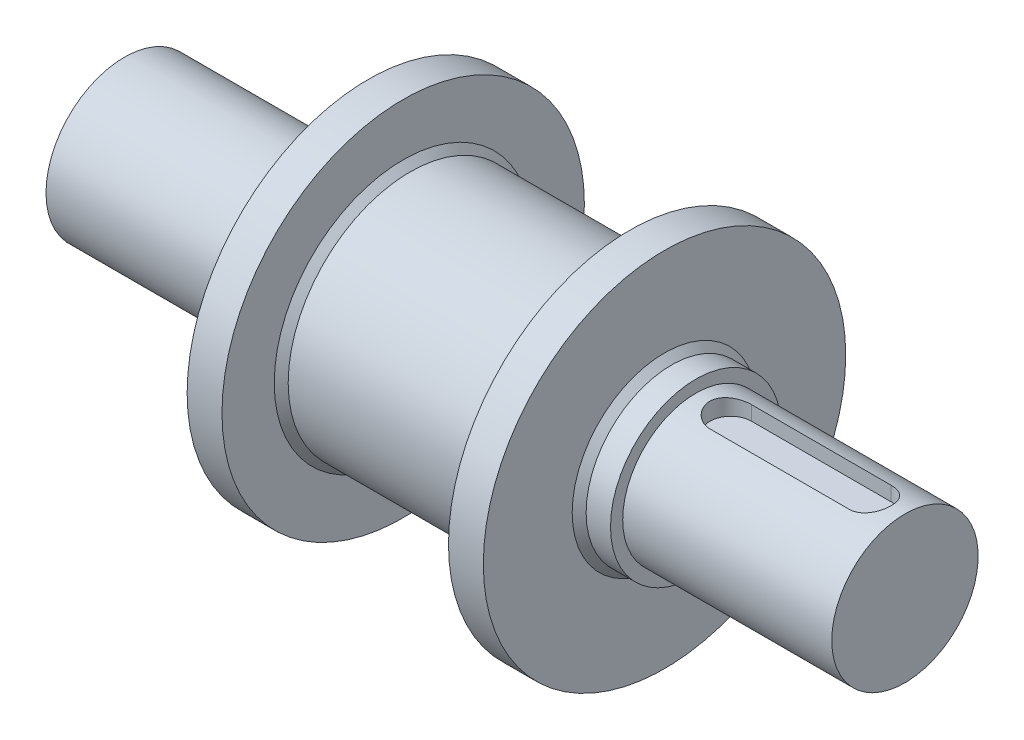
ISO-10303-21;
HEADER;
FILE_DESCRIPTION(('STEP AP214'),'2;1');
FILE_NAME('part.step','',(''),(''),'','','');
FILE_SCHEMA(('AUTOMOTIVE_DESIGN { 1 0 10303 214 1 1 1 1 }'));
ENDSEC;
DATA;
#1=APPLICATION_CONTEXT('core data for automotive mechanical design processes');
#2=APPLICATION_PROTOCOL_DEFINITION('international standard','automotive_design',2000,#1);
#3=PRODUCT_CONTEXT('',#1,'mechanical');
#4=PRODUCT('Part','Part','',(#3));
#5=PRODUCT_RELATED_PRODUCT_CATEGORY('part','',(#4));
#6=PRODUCT_DEFINITION_FORMATION('','',#4);
#7=PRODUCT_DEFINITION_CONTEXT('part definition',#1,'design');
#8=PRODUCT_DEFINITION('design','',#6,#7);
#9=PRODUCT_DEFINITION_SHAPE('','',#8);
#10=(LENGTH_UNIT() NAMED_UNIT(*) SI_UNIT(.MILLI.,.METRE.));
#11=(NAMED_UNIT(*) PLANE_ANGLE_UNIT() SI_UNIT($,.RADIAN.));
#12=(NAMED_UNIT(*) SI_UNIT($,.STERADIAN.) SOLID_ANGLE_UNIT());
#13=UNCERTAINTY_MEASURE_WITH_UNIT(LENGTH_MEASURE(1.E-05),#10,'distance_accuracy_value','');
#14=(GEOMETRIC_REPRESENTATION_CONTEXT(3) GLOBAL_UNCERTAINTY_ASSIGNED_CONTEXT((#13)) GLOBAL_UNIT_ASSIGNED_CONTEXT((#10,
#11,#12)) REPRESENTATION_CONTEXT('',''));
#15=CARTESIAN_POINT('',(0.,0.,0.));
#16=DIRECTION('',(0.,0.,1.));
#17=DIRECTION('',(1.,0.,0.));
#18=AXIS2_PLACEMENT_3D('',#15,#16,#17);
#19=CARTESIAN_POINT('',(0.,0.,0.));
#20=DIRECTION('',(-1.,0.,0.));
#21=DIRECTION('',(0.,0.,1.));
#22=AXIS2_PLACEMENT_3D('',#19,#20,#21);
#23=CYLINDRICAL_SURFACE('',#22,21.);
#24=CARTESIAN_POINT('',(164.,0.,0.));
#25=DIRECTION('',(-1.,0.,0.));
#26=DIRECTION('',(0.,0.,1.));
#27=AXIS2_PLACEMENT_3D('',#24,#25,#26);
#28=CIRCLE('',#27,21.);
#29=CARTESIAN_POINT('',(164.,0.,21.));
#30=VERTEX_POINT('',#29);
#31=EDGE_CURVE('E114',#30,#30,#28,.T.);
#32=ORIENTED_EDGE('',*,*,#31,.F.);
#33=EDGE_LOOP('',(#32));
#34=FACE_BOUND('',#33,.T.);
#35=CARTESIAN_POINT('',(224.,0.,0.));
#36=DIRECTION('',(-1.,0.,0.));
#37=DIRECTION('',(0.,0.,1.));
#38=AXIS2_PLACEMENT_3D('',#35,#36,#37);
#39=CIRCLE('',#38,21.);
#40=CARTESIAN_POINT('',(224.,0.,21.));
#41=VERTEX_POINT('',#40);
#42=EDGE_CURVE('E110',#41,#41,#39,.T.);
#43=ORIENTED_EDGE('',*,*,#42,.T.);
#44=EDGE_LOOP('',(#43));
#45=FACE_BOUND('',#44,.T.);
#46=CARTESIAN_POINT('',(214.,20.1246117974981,6.));
#47=CARTESIAN_POINT('',(214.165052331312,20.1245894844569,6.00002192169975));
#48=CARTESIAN_POINT('',(214.330096651925,20.1266415650335,5.9931904240759));
#49=CARTESIAN_POINT('',(214.658933521624,20.1347317436705,5.96598259693693));
#50=CARTESIAN_POINT('',(214.822726323157,20.1407690151806,5.94560907610498));
#51=CARTESIAN_POINT('',(215.147509956324,20.1566481622527,5.89154299099));
#52=CARTESIAN_POINT('',(215.308506490729,20.1664810208216,5.85788198887895));
#53=CARTESIAN_POINT('',(215.626960229472,20.1896457121068,5.77753958210296));
#54=CARTESIAN_POINT('',(215.78441735477,20.2029776228772,5.73085788698048));
#55=CARTESIAN_POINT('',(216.094635546118,20.2327374247249,5.62488729317033));
#56=CARTESIAN_POINT('',(216.247398940812,20.2491637507907,5.56560476546174));
#57=CARTESIAN_POINT('',(216.547368364294,20.2846467474582,5.43485915630499));
#58=CARTESIAN_POINT('',(216.694572302487,20.3037043952519,5.36339154736579));
#59=CARTESIAN_POINT('',(216.98243459612,20.3439081708857,5.2088169576332));
#60=CARTESIAN_POINT('',(217.123092954147,20.3650542979004,5.12570998143987));
#61=CARTESIAN_POINT('',(217.39705541808,20.4088630364894,4.94839867436059));
#62=CARTESIAN_POINT('',(217.530356713522,20.4315262203764,4.8541901450833));
#63=CARTESIAN_POINT('',(217.792038174735,20.4783436926205,4.65278362553808));
#64=CARTESIAN_POINT('',(217.92020679912,20.5025212494045,4.54531610125277));
#65=CARTESIAN_POINT('',(218.167146297308,20.5511665277305,4.32005021369054));
#66=CARTESIAN_POINT('',(218.285913661986,20.5756343537369,4.2022480271534));
#67=CARTESIAN_POINT('',(218.513215821272,20.6241797197623,3.95712206741071));
#68=CARTESIAN_POINT('',(218.621752630169,20.6482573358332,3.82980017742366));
#69=CARTESIAN_POINT('',(218.827939004997,20.6953839164428,3.56636964243007));
#70=CARTESIAN_POINT('',(218.925584545105,20.7184324987362,3.43025777747806));
#71=CARTESIAN_POINT('',(219.110945589449,20.7632735217347,3.14758929991082));
#72=CARTESIAN_POINT('',(219.198446889581,20.7850352899035,3.00088721837234));
#73=CARTESIAN_POINT('',(219.360771883345,20.826226420028,2.7002441525681));
#74=CARTESIAN_POINT('',(219.435591029334,20.8456549445903,2.54630059678401));
#75=CARTESIAN_POINT('',(219.571883383942,20.8816082415408,2.23235057760216));
#76=CARTESIAN_POINT('',(219.633361393562,20.898134058101,2.07234631966332));
#77=CARTESIAN_POINT('',(219.742475461034,20.9278108104084,1.74738349510969));
#78=CARTESIAN_POINT('',(219.790112095636,20.9409618867737,1.58242513524158));
#79=CARTESIAN_POINT('',(219.870065575121,20.9632114411614,1.25311298298007));
#80=CARTESIAN_POINT('',(219.902747347622,20.9724060858907,1.08885424992111));
#81=CARTESIAN_POINT('',(219.954270098755,20.9869654862023,0.758072191863194));
#82=CARTESIAN_POINT('',(219.973116248908,20.9923316727767,0.591549736734751));
#83=CARTESIAN_POINT('',(219.996814450333,20.9990869856429,0.257425560637054));
#84=CARTESIAN_POINT('',(220.001666015127,21.0004759736798,0.0898238023521118));
#85=CARTESIAN_POINT('',(219.997328274917,20.999236691677,-0.245181542828502));
#86=CARTESIAN_POINT('',(219.988139201944,20.9966084880238,-0.412585132953262));
#87=CARTESIAN_POINT('',(219.9562782772,20.9875445764644,-0.741067651658926));
#88=CARTESIAN_POINT('',(219.934007021276,20.9812220240654,-0.902188755140109));
#89=CARTESIAN_POINT('',(219.876494480959,20.9650286514685,-1.2219709065223));
#90=CARTESIAN_POINT('',(219.841249023442,20.9551566896347,-1.38063114576115));
#91=CARTESIAN_POINT('',(219.758089652863,20.9321284663263,-1.69432288207988));
#92=CARTESIAN_POINT('',(219.710177676022,20.918972706835,-1.84935492983109));
#93=CARTESIAN_POINT('',(219.602064962077,20.8897205698511,-2.15478873602949));
#94=CARTESIAN_POINT('',(219.541863855878,20.8736241040379,-2.30519035524902));
#95=CARTESIAN_POINT('',(219.408898376357,20.8387145142278,-2.60202980978099));
#96=CARTESIAN_POINT('',(219.336002252832,20.8198732783987,-2.74840530116376));
#97=CARTESIAN_POINT('',(219.178676237705,20.7801082571492,-3.0344604453685));
#98=CARTESIAN_POINT('',(219.09424991134,20.7591851160121,-3.17414215000025));
#99=CARTESIAN_POINT('',(218.914385979091,20.7157807359019,-3.44606990247429));
#100=CARTESIAN_POINT('',(218.818942919324,20.6932987274225,-3.57831221881557));
#101=CARTESIAN_POINT('',(218.617740718797,20.6473712971919,-3.83444718075925));
#102=CARTESIAN_POINT('',(218.511984957411,20.6239261924859,-3.95834253922789));
#103=CARTESIAN_POINT('',(218.28687436197,20.5758300072593,-4.20132091996745));
#104=CARTESIAN_POINT('',(218.16717064798,20.551165615785,-4.32007832115665));
#105=CARTESIAN_POINT('',(217.918208426459,20.5021333353903,-4.54708837545201));
#106=CARTESIAN_POINT('',(217.788953240124,20.4777653468064,-4.65534464996527));
#107=CARTESIAN_POINT('',(217.52158790413,20.4299846752419,-4.86074636422664));
#108=CARTESIAN_POINT('',(217.383471887605,20.406572642352,-4.95788432140758));
#109=CARTESIAN_POINT('',(217.099406524312,20.3614014610979,-5.14024855061121));
#110=CARTESIAN_POINT('',(216.953460255218,20.3396416713267,-5.22547945590107));
#111=CARTESIAN_POINT('',(216.65330100046,20.2982196174412,-5.38414968403492));
#112=CARTESIAN_POINT('',(216.499025684695,20.2785778839985,-5.45747656574094));
#113=CARTESIAN_POINT('',(216.184550166332,20.242230137917,-5.59078652189583));
#114=CARTESIAN_POINT('',(216.024352400501,20.2255229337991,-5.65077501464742));
#115=CARTESIAN_POINT('',(215.699294796548,20.1955798271004,-5.7568738046708));
#116=CARTESIAN_POINT('',(215.534440027613,20.1823402998656,-5.80299860073584));
#117=CARTESIAN_POINT('',(215.201205342495,20.1597438752569,-5.88101802101864));
#118=CARTESIAN_POINT('',(215.032827097457,20.1503851792111,-5.91291923804017));
#119=CARTESIAN_POINT('',(214.720401863552,20.136996182678,-5.95834488604588));
#120=CARTESIAN_POINT('',(214.576682044629,20.1323602730056,-5.97396720737166));
#121=CARTESIAN_POINT('',(214.288645245918,20.1261641867038,-5.99479248698429));
#122=CARTESIAN_POINT('',(214.144329514862,20.1245993190641,-6.00001133674436));
#123=CARTESIAN_POINT('',(214.,20.1246117974981,-6.));
#124=B_SPLINE_CURVE_WITH_KNOTS('',3,(#46,#47,#48,#49,#50,#51,#52,#53,#54,#55,#56,#57,#58,#59,
#60,#61,#62,#63,#64,#65,#66,#67,#68,#69,#70,#71,#72,#73,#74,#75,#76,#77,#78,#79,#80,#81,#82,#83,
#84,#85,#86,#87,#88,#89,#90,#91,#92,#93,#94,#95,#96,#97,#98,#99,#100,#101,#102,#103,#104,#105,
#106,#107,#108,#109,#110,#111,#112,#113,#114,#115,#116,#117,#118,#119,#120,#121,#122,#123),
.UNSPECIFIED.,.F.,.F.,(4,2,2,2,2,2,2,2,2,2,2,2,2,2,2,2,2,2,2,2,2,2,2,2,2,2,2,2,2,2,2,2,2,2,2,2,
2,2,4),(0.,0.49499061456547,0.989878597629598,1.48359806377504,1.97732854438847,
2.47080998622047,2.96447518729514,3.45814019326605,3.95199249653474,4.4584116134109,
4.9650188741466,5.47152618001261,5.97822009394079,6.49417839820205,7.01032132824592,
7.52627820764116,8.04221358474347,8.54478221320035,9.04716289419293,9.54956103869483,
10.0519508808723,10.5397044924402,11.027615126156,11.5154512202231,12.0033019682409,
12.4965554906444,12.9896568387743,13.4830033544228,13.9761887449054,14.4868330315598,
14.997300587207,15.5081096895234,16.0187194690592,16.5339022452487,17.0488753606756,
17.5633080229981,18.077501990939,18.5110248049339,18.9438848967365),.UNSPECIFIED.);
#125=CARTESIAN_POINT('',(214.,20.1246117974981,6.));
#126=VERTEX_POINT('',#125);
#127=CARTESIAN_POINT('',(214.,20.1246117974981,-6.));
#128=VERTEX_POINT('',#127);
#129=EDGE_CURVE('E11',#126,#128,#124,.T.);
#130=ORIENTED_EDGE('',*,*,#129,.F.);
#131=DIRECTION('',(-1.,0.,0.));
#132=VECTOR('',#131,1.);
#133=CARTESIAN_POINT('',(0.,20.1246117974981,6.00000000000003));
#134=LINE('',#133,#132);
#135=CARTESIAN_POINT('',(174.,20.1246117974981,6.));
#136=VERTEX_POINT('',#135);
#137=EDGE_CURVE('E49',#126,#136,#134,.T.);
#138=ORIENTED_EDGE('',*,*,#137,.T.);
#139=CARTESIAN_POINT('',(174.,20.1246117974981,6.));
#140=CARTESIAN_POINT('',(173.834947668688,20.1245894844569,6.00002192169975));
#141=CARTESIAN_POINT('',(173.669903348075,20.1266415650335,5.9931904240759));
#142=CARTESIAN_POINT('',(173.341066478376,20.1347317436705,5.96598259693693));
#143=CARTESIAN_POINT('',(173.177273676843,20.1407690151806,5.94560907610498));
#144=CARTESIAN_POINT('',(172.852490043676,20.1566481622527,5.89154299099));
#145=CARTESIAN_POINT('',(172.691493509271,20.1664810208216,5.85788198887895));
#146=CARTESIAN_POINT('',(172.373039770528,20.1896457121068,5.77753958210296));
#147=CARTESIAN_POINT('',(172.21558264523,20.2029776228772,5.73085788698049));
#148=CARTESIAN_POINT('',(171.905364453882,20.2327374247249,5.62488729317033));
#149=CARTESIAN_POINT('',(171.752601059188,20.2491637507907,5.56560476546174));
#150=CARTESIAN_POINT('',(171.452631635706,20.2846467474582,5.43485915630499));
#151=CARTESIAN_POINT('',(171.305427697513,20.3037043952519,5.36339154736579));
#152=CARTESIAN_POINT('',(171.01756540388,20.3439081708857,5.2088169576332));
#153=CARTESIAN_POINT('',(170.876907045853,20.3650542979004,5.12570998143987));
#154=CARTESIAN_POINT('',(170.602944581921,20.4088630364894,4.94839867436059));
#155=CARTESIAN_POINT('',(170.469643286478,20.4315262203764,4.8541901450833));
#156=CARTESIAN_POINT('',(170.207961825265,20.4783436926205,4.65278362553808));
#157=CARTESIAN_POINT('',(170.07979320088,20.5025212494045,4.54531610125277));
#158=CARTESIAN_POINT('',(169.832853702692,20.5511665277305,4.32005021369054));
#159=CARTESIAN_POINT('',(169.714086338014,20.5756343537369,4.2022480271534));
#160=CARTESIAN_POINT('',(169.486784178728,20.6241797197623,3.95712206741071));
#161=CARTESIAN_POINT('',(169.378247369832,20.6482573358332,3.82980017742366));
#162=CARTESIAN_POINT('',(169.172060995003,20.6953839164428,3.56636964243007));
#163=CARTESIAN_POINT('',(169.074415454895,20.7184324987362,3.43025777747806));
#164=CARTESIAN_POINT('',(168.889054410551,20.7632735217347,3.14758929991082));
#165=CARTESIAN_POINT('',(168.801553110419,20.7850352899035,3.00088721837234));
#166=CARTESIAN_POINT('',(168.639228116655,20.826226420028,2.7002441525681));
#167=CARTESIAN_POINT('',(168.564408970666,20.8456549445903,2.54630059678401));
#168=CARTESIAN_POINT('',(168.428116616058,20.8816082415408,2.23235057760216));
#169=CARTESIAN_POINT('',(168.366638606438,20.898134058101,2.07234631966332));
#170=CARTESIAN_POINT('',(168.257524538966,20.9278108104084,1.74738349510969));
#171=CARTESIAN_POINT('',(168.209887904364,20.9409618867737,1.58242513524158));
#172=CARTESIAN_POINT('',(168.129934424879,20.9632114411614,1.25311298298007));
#173=CARTESIAN_POINT('',(168.097252652378,20.9724060858907,1.08885424992111));
#174=CARTESIAN_POINT('',(168.045729901245,20.9869654862023,0.758072191863196));
#175=CARTESIAN_POINT('',(168.026883751092,20.9923316727767,0.591549736734753));
#176=CARTESIAN_POINT('',(168.003185549667,20.9990869856429,0.257425560637055));
#177=CARTESIAN_POINT('',(167.998333984873,21.0004759736798,0.0898238023521125));
#178=CARTESIAN_POINT('',(168.002671725083,20.999236691677,-0.245181542828501));
#179=CARTESIAN_POINT('',(168.011860798056,20.9966084880238,-0.412585132953262));
#180=CARTESIAN_POINT('',(168.0437217228,20.9875445764644,-0.741067651658926));
#181=CARTESIAN_POINT('',(168.065992978724,20.9812220240654,-0.902188755140109));
#182=CARTESIAN_POINT('',(168.123505519041,20.9650286514685,-1.2219709065223));
#183=CARTESIAN_POINT('',(168.158750976558,20.9551566896347,-1.38063114576115));
#184=CARTESIAN_POINT('',(168.241910347137,20.9321284663263,-1.69432288207988));
#185=CARTESIAN_POINT('',(168.289822323978,20.918972706835,-1.84935492983109));
#186=CARTESIAN_POINT('',(168.397935037923,20.8897205698511,-2.15478873602948));
#187=CARTESIAN_POINT('',(168.458136144122,20.8736241040379,-2.30519035524902));
#188=CARTESIAN_POINT('',(168.591101623643,20.8387145142278,-2.60202980978099));
#189=CARTESIAN_POINT('',(168.663997747168,20.8198732783987,-2.74840530116376));
#190=CARTESIAN_POINT('',(168.821323762295,20.7801082571492,-3.0344604453685));
#191=CARTESIAN_POINT('',(168.90575008866,20.7591851160121,-3.17414215000025));
#192=CARTESIAN_POINT('',(169.085614020909,20.7157807359019,-3.44606990247429));
#193=CARTESIAN_POINT('',(169.181057080676,20.6932987274225,-3.57831221881557));
#194=CARTESIAN_POINT('',(169.382259281203,20.6473712971919,-3.83444718075925));
#195=CARTESIAN_POINT('',(169.488015042589,20.6239261924859,-3.95834253922789));
#196=CARTESIAN_POINT('',(169.71312563803,20.5758300072593,-4.20132091996745));
#197=CARTESIAN_POINT('',(169.83282935202,20.551165615785,-4.32007832115665));
#198=CARTESIAN_POINT('',(170.081791573541,20.5021333353903,-4.54708837545201));
#199=CARTESIAN_POINT('',(170.211046759876,20.4777653468064,-4.65534464996527));
#200=CARTESIAN_POINT('',(170.47841209587,20.4299846752419,-4.86074636422664));
#201=CARTESIAN_POINT('',(170.616528112395,20.406572642352,-4.95788432140758));
#202=CARTESIAN_POINT('',(170.900593475688,20.3614014610979,-5.14024855061121));
#203=CARTESIAN_POINT('',(171.046539744782,20.3396416713267,-5.22547945590107));
#204=CARTESIAN_POINT('',(171.34669899954,20.2982196174412,-5.38414968403492));
#205=CARTESIAN_POINT('',(171.500974315305,20.2785778839985,-5.45747656574094));
#206=CARTESIAN_POINT('',(171.815449833668,20.242230137917,-5.59078652189583));
#207=CARTESIAN_POINT('',(171.975647599499,20.2255229337991,-5.65077501464742));
#208=CARTESIAN_POINT('',(172.300705203452,20.1955798271004,-5.7568738046708));
#209=CARTESIAN_POINT('',(172.465559972387,20.1823402998656,-5.80299860073584));
#210=CARTESIAN_POINT('',(172.798794657505,20.1597438752569,-5.88101802101863));
#211=CARTESIAN_POINT('',(172.967172902543,20.1503851792111,-5.91291923804017));
#212=CARTESIAN_POINT('',(173.279598136448,20.136996182678,-5.95834488604588));
#213=CARTESIAN_POINT('',(173.423317955371,20.1323602730056,-5.97396720737166));
#214=CARTESIAN_POINT('',(173.711354754082,20.1261641867038,-5.99479248698429));
#215=CARTESIAN_POINT('',(173.855670485138,20.1245993190641,-6.00001133674436));
#216=CARTESIAN_POINT('',(174.,20.1246117974981,-6.));
#217=B_SPLINE_CURVE_WITH_KNOTS('',3,(#139,#140,#141,#142,#143,#144,#145,#146,#147,#148,#149,
#150,#151,#152,#153,#154,#155,#156,#157,#158,#159,#160,#161,#162,#163,#164,#165,#166,#167,#168,
#169,#170,#171,#172,#173,#174,#175,#176,#177,#178,#179,#180,#181,#182,#183,#184,#185,#186,#187,
#188,#189,#190,#191,#192,#193,#194,#195,#196,#197,#198,#199,#200,#201,#202,#203,#204,#205,#206,
#207,#208,#209,#210,#211,#212,#213,#214,#215,#216),.UNSPECIFIED.,.F.,.F.,(4,2,2,2,2,2,2,2,2,2,2,
2,2,2,2,2,2,2,2,2,2,2,2,2,2,2,2,2,2,2,2,2,2,2,2,2,2,2,4),(0.,0.49499061456547,0.989878597629598,
1.48359806377502,1.97732854438847,2.47080998622047,2.96447518729514,3.45814019326605,
3.95199249653474,4.4584116134109,4.9650188741466,5.47152618001261,5.97822009394079,
6.49417839820205,7.01032132824592,7.52627820764116,8.04221358474347,8.54478221320034,
9.04716289419293,9.54956103869483,10.0519508808723,10.5397044924402,11.027615126156,
11.5154512202231,12.0033019682409,12.4965554906444,12.9896568387743,13.4830033544228,
13.9761887449054,14.4868330315598,14.997300587207,15.5081096895234,16.0187194690592,
16.5339022452487,17.0488753606756,17.563308022998,18.077501990939,18.5110248049339,
18.9438848967365),.UNSPECIFIED.);
#218=CARTESIAN_POINT('',(174.,20.1246117974981,-6.));
#219=VERTEX_POINT('',#218);
#220=EDGE_CURVE('E61',#136,#219,#217,.T.);
#221=ORIENTED_EDGE('',*,*,#220,.T.);
#222=DIRECTION('',(-1.,0.,0.));
#223=VECTOR('',#222,1.);
#224=CARTESIAN_POINT('',(0.,20.1246117974981,-5.99999999999997));
#225=LINE('',#224,#223);
#226=EDGE_CURVE('E168',#219,#128,#225,.F.);
#227=ORIENTED_EDGE('',*,*,#226,.T.);
#228=EDGE_LOOP('',(#130,#138,#221,#227));
#229=FACE_BOUND('',#228,.T.);
#230=ADVANCED_FACE('F34',(#34,#45,#229),#23,.T.);
#231=CARTESIAN_POINT('',(0.,0.,0.));
#232=DIRECTION('',(1.,0.,0.));
#233=DIRECTION('',(0.,0.,-1.));
#234=AXIS2_PLACEMENT_3D('',#231,#232,#233);
#235=PLANE('',#234);
#236=CARTESIAN_POINT('',(0.,0.,0.));
#237=DIRECTION('',(-1.,0.,0.));
#238=DIRECTION('',(0.,0.,1.));
#239=AXIS2_PLACEMENT_3D('',#236,#237,#238);
#240=CIRCLE('',#239,22.5);
#241=CARTESIAN_POINT('',(0.,0.,22.5));
#242=VERTEX_POINT('',#241);
#243=EDGE_CURVE('E141',#242,#242,#240,.T.);
#244=ORIENTED_EDGE('',*,*,#243,.T.);
#245=EDGE_LOOP('',(#244));
#246=FACE_BOUND('',#245,.T.);
#247=ADVANCED_FACE('F197',(#246),#235,.F.);
#248=CARTESIAN_POINT('',(0.,0.,0.));
#249=DIRECTION('',(-1.,0.,0.));
#250=DIRECTION('',(0.,0.,1.));
#251=AXIS2_PLACEMENT_3D('',#248,#249,#250);
#252=CYLINDRICAL_SURFACE('',#251,22.5);
#253=ORIENTED_EDGE('',*,*,#243,.F.);
#254=EDGE_LOOP('',(#253));
#255=FACE_BOUND('',#254,.T.);
#256=CARTESIAN_POINT('',(65.,0.,0.));
#257=DIRECTION('',(-1.,0.,0.));
#258=DIRECTION('',(0.,0.,1.));
#259=AXIS2_PLACEMENT_3D('',#256,#257,#258);
#260=CIRCLE('',#259,22.5);
#261=CARTESIAN_POINT('',(65.,0.,22.5));
#262=VERTEX_POINT('',#261);
#263=EDGE_CURVE('E138',#262,#262,#260,.T.);
#264=ORIENTED_EDGE('',*,*,#263,.T.);
#265=EDGE_LOOP('',(#264));
#266=FACE_BOUND('',#265,.T.);
#267=ADVANCED_FACE('F202',(#255,#266),#252,.T.);
#268=CARTESIAN_POINT('',(65.,22.5,0.));
#269=DIRECTION('',(1.,0.,0.));
#270=DIRECTION('',(0.,0.,-1.));
#271=AXIS2_PLACEMENT_3D('',#268,#269,#270);
#272=PLANE('',#271);
#273=ORIENTED_EDGE('',*,*,#263,.F.);
#274=EDGE_LOOP('',(#273));
#275=FACE_BOUND('',#274,.T.);
#276=CARTESIAN_POINT('',(65.,0.,0.));
#277=DIRECTION('',(-1.,0.,0.));
#278=DIRECTION('',(0.,0.,1.));
#279=AXIS2_PLACEMENT_3D('',#276,#277,#278);
#280=CIRCLE('',#279,27.);
#281=CARTESIAN_POINT('',(65.,0.,27.));
#282=VERTEX_POINT('',#281);
#283=EDGE_CURVE('E135',#282,#282,#280,.T.);
#284=ORIENTED_EDGE('',*,*,#283,.T.);
#285=EDGE_LOOP('',(#284));
#286=FACE_BOUND('',#285,.T.);
#287=ADVANCED_FACE('F212',(#275,#286),#272,.F.);
#288=CARTESIAN_POINT('',(0.,0.,0.));
#289=DIRECTION('',(-1.,0.,0.));
#290=DIRECTION('',(0.,0.,1.));
#291=AXIS2_PLACEMENT_3D('',#288,#289,#290);
#292=CYLINDRICAL_SURFACE('',#291,27.);
#293=ORIENTED_EDGE('',*,*,#283,.F.);
#294=EDGE_LOOP('',(#293));
#295=FACE_BOUND('',#294,.T.);
#296=CARTESIAN_POINT('',(70.,0.,0.));
#297=DIRECTION('',(-1.,0.,0.));
#298=DIRECTION('',(0.,0.,1.));
#299=AXIS2_PLACEMENT_3D('',#296,#297,#298);
#300=CIRCLE('',#299,27.);
#301=CARTESIAN_POINT('',(70.,0.,27.));
#302=VERTEX_POINT('',#301);
#303=EDGE_CURVE('E132',#302,#302,#300,.T.);
#304=ORIENTED_EDGE('',*,*,#303,.T.);
#305=EDGE_LOOP('',(#304));
#306=FACE_BOUND('',#305,.T.);
#307=ADVANCED_FACE('F255',(#295,#306),#292,.T.);
#308=CARTESIAN_POINT('',(70.,27.,0.));
#309=DIRECTION('',(1.,0.,0.));
#310=DIRECTION('',(0.,0.,-1.));
#311=AXIS2_PLACEMENT_3D('',#308,#309,#310);
#312=PLANE('',#311);
#313=ORIENTED_EDGE('',*,*,#303,.F.);
#314=EDGE_LOOP('',(#313));
#315=FACE_BOUND('',#314,.T.);
#316=CARTESIAN_POINT('',(70.,0.,0.));
#317=DIRECTION('',(-1.,0.,0.));
#318=DIRECTION('',(0.,0.,1.));
#319=AXIS2_PLACEMENT_3D('',#316,#317,#318);
#320=CIRCLE('',#319,52.);
#321=CARTESIAN_POINT('',(70.,0.,52.));
#322=VERTEX_POINT('',#321);
#323=EDGE_CURVE('E129',#322,#322,#320,.T.);
#324=ORIENTED_EDGE('',*,*,#323,.T.);
#325=EDGE_LOOP('',(#324));
#326=FACE_BOUND('',#325,.T.);
#327=ADVANCED_FACE('F249',(#315,#326),#312,.F.);
#328=CARTESIAN_POINT('',(0.,0.,0.));
#329=DIRECTION('',(-1.,0.,0.));
#330=DIRECTION('',(0.,0.,1.));
#331=AXIS2_PLACEMENT_3D('',#328,#329,#330);
#332=CYLINDRICAL_SURFACE('',#331,52.);
#333=ORIENTED_EDGE('',*,*,#323,.F.);
#334=EDGE_LOOP('',(#333));
#335=FACE_BOUND('',#334,.T.);
#336=CARTESIAN_POINT('',(80.,0.,0.));
#337=DIRECTION('',(-1.,0.,0.));
#338=DIRECTION('',(0.,0.,1.));
#339=AXIS2_PLACEMENT_3D('',#336,#337,#338);
#340=CIRCLE('',#339,52.);
#341=CARTESIAN_POINT('',(80.,0.,52.));
#342=VERTEX_POINT('',#341);
#343=EDGE_CURVE('E126',#342,#342,#340,.T.);
#344=ORIENTED_EDGE('',*,*,#343,.T.);
#345=EDGE_LOOP('',(#344));
#346=FACE_BOUND('',#345,.T.);
#347=ADVANCED_FACE('F244',(#335,#346),#332,.T.);
#348=CARTESIAN_POINT('',(80.,52.,0.));
#349=DIRECTION('',(-1.,0.,0.));
#350=DIRECTION('',(0.,0.,1.));
#351=AXIS2_PLACEMENT_3D('',#348,#349,#350);
#352=PLANE('',#351);
#353=CARTESIAN_POINT('',(80.,0.,0.));
#354=DIRECTION('',(-1.,0.,0.));
#355=DIRECTION('',(0.,0.,1.));
#356=AXIS2_PLACEMENT_3D('',#353,#354,#355);
#357=CIRCLE('',#356,37.);
#358=CARTESIAN_POINT('',(80.,0.,37.));
#359=VERTEX_POINT('',#358);
#360=EDGE_CURVE('E159',#359,#359,#357,.T.);
#361=ORIENTED_EDGE('',*,*,#360,.T.);
#362=EDGE_LOOP('',(#361));
#363=FACE_BOUND('',#362,.T.);
#364=ORIENTED_EDGE('',*,*,#343,.F.);
#365=EDGE_LOOP('',(#364));
#366=FACE_BOUND('',#365,.T.);
#367=ADVANCED_FACE('F236',(#363,#366),#352,.F.);
#368=CARTESIAN_POINT('',(0.,0.,0.));
#369=DIRECTION('',(-1.,0.,0.));
#370=DIRECTION('',(0.,0.,1.));
#371=AXIS2_PLACEMENT_3D('',#368,#369,#370);
#372=CYLINDRICAL_SURFACE('',#371,35.);
#373=CARTESIAN_POINT('',(143.,0.,0.));
#374=DIRECTION('',(1.,0.,0.));
#375=DIRECTION('',(0.,0.,-1.));
#376=AXIS2_PLACEMENT_3D('',#373,#374,#375);
#377=CIRCLE('',#376,35.);
#378=CARTESIAN_POINT('',(143.,0.,-35.));
#379=VERTEX_POINT('',#378);
#380=EDGE_CURVE('E153',#379,#379,#377,.F.);
#381=ORIENTED_EDGE('',*,*,#380,.T.);
#382=EDGE_LOOP('',(#381));
#383=FACE_BOUND('',#382,.T.);
#384=CARTESIAN_POINT('',(82.,0.,0.));
#385=DIRECTION('',(-1.,0.,0.));
#386=DIRECTION('',(0.,0.,1.));
#387=AXIS2_PLACEMENT_3D('',#384,#385,#386);
#388=CIRCLE('',#387,35.);
#389=CARTESIAN_POINT('',(82.,0.,35.));
#390=VERTEX_POINT('',#389);
#391=EDGE_CURVE('E150',#390,#390,#388,.F.);
#392=ORIENTED_EDGE('',*,*,#391,.T.);
#393=EDGE_LOOP('',(#392));
#394=FACE_BOUND('',#393,.T.);
#395=ADVANCED_FACE('F232',(#383,#394),#372,.T.);
#396=CARTESIAN_POINT('',(145.,35.,0.));
#397=DIRECTION('',(1.,0.,0.));
#398=DIRECTION('',(0.,0.,-1.));
#399=AXIS2_PLACEMENT_3D('',#396,#397,#398);
#400=PLANE('',#399);
#401=CARTESIAN_POINT('',(145.,0.,0.));
#402=DIRECTION('',(1.,0.,0.));
#403=DIRECTION('',(0.,0.,-1.));
#404=AXIS2_PLACEMENT_3D('',#401,#402,#403);
#405=CIRCLE('',#404,37.);
#406=CARTESIAN_POINT('',(145.,0.,-37.));
#407=VERTEX_POINT('',#406);
#408=EDGE_CURVE('E156',#407,#407,#405,.T.);
#409=ORIENTED_EDGE('',*,*,#408,.T.);
#410=EDGE_LOOP('',(#409));
#411=FACE_BOUND('',#410,.T.);
#412=CARTESIAN_POINT('',(145.,0.,0.));
#413=DIRECTION('',(-1.,0.,0.));
#414=DIRECTION('',(0.,0.,1.));
#415=AXIS2_PLACEMENT_3D('',#412,#413,#414);
#416=CIRCLE('',#415,52.);
#417=CARTESIAN_POINT('',(145.,0.,52.));
#418=VERTEX_POINT('',#417);
#419=EDGE_CURVE('E123',#418,#418,#416,.T.);
#420=ORIENTED_EDGE('',*,*,#419,.T.);
#421=EDGE_LOOP('',(#420));
#422=FACE_BOUND('',#421,.T.);
#423=ADVANCED_FACE('F235',(#411,#422),#400,.F.);
#424=CARTESIAN_POINT('',(0.,0.,0.));
#425=DIRECTION('',(-1.,0.,0.));
#426=DIRECTION('',(0.,0.,1.));
#427=AXIS2_PLACEMENT_3D('',#424,#425,#426);
#428=CYLINDRICAL_SURFACE('',#427,52.);
#429=ORIENTED_EDGE('',*,*,#419,.F.);
#430=EDGE_LOOP('',(#429));
#431=FACE_BOUND('',#430,.T.);
#432=CARTESIAN_POINT('',(155.,0.,0.));
#433=DIRECTION('',(-1.,0.,0.));
#434=DIRECTION('',(0.,0.,1.));
#435=AXIS2_PLACEMENT_3D('',#432,#433,#434);
#436=CIRCLE('',#435,52.);
#437=CARTESIAN_POINT('',(155.,0.,52.));
#438=VERTEX_POINT('',#437);
#439=EDGE_CURVE('E120',#438,#438,#436,.T.);
#440=ORIENTED_EDGE('',*,*,#439,.T.);
#441=EDGE_LOOP('',(#440));
#442=FACE_BOUND('',#441,.T.);
#443=ADVANCED_FACE('F293',(#431,#442),#428,.T.);
#444=CARTESIAN_POINT('',(155.,52.,0.));
#445=DIRECTION('',(-1.,0.,0.));
#446=DIRECTION('',(0.,0.,1.));
#447=AXIS2_PLACEMENT_3D('',#444,#445,#446);
#448=PLANE('',#447);
#449=CARTESIAN_POINT('',(155.,0.,0.));
#450=DIRECTION('',(-1.,0.,0.));
#451=DIRECTION('',(0.,0.,1.));
#452=AXIS2_PLACEMENT_3D('',#449,#450,#451);
#453=CIRCLE('',#452,26.4999999999999);
#454=CARTESIAN_POINT('',(155.,0.,26.4999999999999));
#455=VERTEX_POINT('',#454);
#456=EDGE_CURVE('E144',#455,#455,#453,.T.);
#457=ORIENTED_EDGE('',*,*,#456,.T.);
#458=EDGE_LOOP('',(#457));
#459=FACE_BOUND('',#458,.T.);
#460=ORIENTED_EDGE('',*,*,#439,.F.);
#461=EDGE_LOOP('',(#460));
#462=FACE_BOUND('',#461,.T.);
#463=ADVANCED_FACE('F298',(#459,#462),#448,.F.);
#464=CARTESIAN_POINT('',(0.,0.,0.));
#465=DIRECTION('',(-1.,0.,0.));
#466=DIRECTION('',(0.,0.,1.));
#467=AXIS2_PLACEMENT_3D('',#464,#465,#466);
#468=CYLINDRICAL_SURFACE('',#467,24.5);
#469=CARTESIAN_POINT('',(157.,0.,0.));
#470=DIRECTION('',(-1.,0.,0.));
#471=DIRECTION('',(0.,0.,1.));
#472=AXIS2_PLACEMENT_3D('',#469,#470,#471);
#473=CIRCLE('',#472,24.5);
#474=CARTESIAN_POINT('',(157.,0.,24.5));
#475=VERTEX_POINT('',#474);
#476=EDGE_CURVE('E147',#475,#475,#473,.F.);
#477=ORIENTED_EDGE('',*,*,#476,.T.);
#478=EDGE_LOOP('',(#477));
#479=FACE_BOUND('',#478,.T.);
#480=CARTESIAN_POINT('',(164.,0.,0.));
#481=DIRECTION('',(-1.,0.,0.));
#482=DIRECTION('',(0.,0.,1.));
#483=AXIS2_PLACEMENT_3D('',#480,#481,#482);
#484=CIRCLE('',#483,24.5);
#485=CARTESIAN_POINT('',(164.,0.,24.5));
#486=VERTEX_POINT('',#485);
#487=EDGE_CURVE('E117',#486,#486,#484,.T.);
#488=ORIENTED_EDGE('',*,*,#487,.T.);
#489=EDGE_LOOP('',(#488));
#490=FACE_BOUND('',#489,.T.);
#491=ADVANCED_FACE('F193',(#479,#490),#468,.T.);
#492=CARTESIAN_POINT('',(164.,24.5,0.));
#493=DIRECTION('',(-1.,0.,0.));
#494=DIRECTION('',(0.,0.,1.));
#495=AXIS2_PLACEMENT_3D('',#492,#493,#494);
#496=PLANE('',#495);
#497=ORIENTED_EDGE('',*,*,#487,.F.);
#498=EDGE_LOOP('',(#497));
#499=FACE_BOUND('',#498,.T.);
#500=ORIENTED_EDGE('',*,*,#31,.T.);
#501=EDGE_LOOP('',(#500));
#502=FACE_BOUND('',#501,.T.);
#503=ADVANCED_FACE('F184',(#499,#502),#496,.F.);
#504=CARTESIAN_POINT('',(224.,21.,0.));
#505=DIRECTION('',(-1.,0.,0.));
#506=DIRECTION('',(0.,0.,1.));
#507=AXIS2_PLACEMENT_3D('',#504,#505,#506);
#508=PLANE('',#507);
#509=ORIENTED_EDGE('',*,*,#42,.F.);
#510=EDGE_LOOP('',(#509));
#511=FACE_BOUND('',#510,.T.);
#512=ADVANCED_FACE('F181',(#511),#508,.F.);
#513=CARTESIAN_POINT('',(155.,0.,0.));
#514=DIRECTION('',(-1.,0.,0.));
#515=DIRECTION('',(0.,0.,1.));
#516=AXIS2_PLACEMENT_3D('',#513,#514,#515);
#517=CONICAL_SURFACE('',#516,26.4999999999999,0.785398163397453);
#518=ORIENTED_EDGE('',*,*,#476,.F.);
#519=EDGE_LOOP('',(#518));
#520=FACE_BOUND('',#519,.T.);
#521=ORIENTED_EDGE('',*,*,#456,.F.);
#522=EDGE_LOOP('',(#521));
#523=FACE_BOUND('',#522,.T.);
#524=ADVANCED_FACE('F183',(#520,#523),#517,.T.);
#525=CARTESIAN_POINT('',(143.,0.,0.));
#526=DIRECTION('',(1.,0.,0.));
#527=DIRECTION('',(0.,0.,-1.));
#528=AXIS2_PLACEMENT_3D('',#525,#526,#527);
#529=CONICAL_SURFACE('',#528,35.,0.785398163397448);
#530=ORIENTED_EDGE('',*,*,#408,.F.);
#531=EDGE_LOOP('',(#530));
#532=FACE_BOUND('',#531,.T.);
#533=ORIENTED_EDGE('',*,*,#380,.F.);
#534=EDGE_LOOP('',(#533));
#535=FACE_BOUND('',#534,.T.);
#536=ADVANCED_FACE('F190',(#532,#535),#529,.T.);
#537=CARTESIAN_POINT('',(80.,0.,0.));
#538=DIRECTION('',(-1.,0.,0.));
#539=DIRECTION('',(0.,0.,1.));
#540=AXIS2_PLACEMENT_3D('',#537,#538,#539);
#541=CONICAL_SURFACE('',#540,37.,0.785398163397448);
#542=ORIENTED_EDGE('',*,*,#391,.F.);
#543=EDGE_LOOP('',(#542));
#544=FACE_BOUND('',#543,.T.);
#545=ORIENTED_EDGE('',*,*,#360,.F.);
#546=EDGE_LOOP('',(#545));
#547=FACE_BOUND('',#546,.T.);
#548=ADVANCED_FACE('F37',(#544,#547),#541,.T.);
#549=CARTESIAN_POINT('',(194.,16.,-6.));
#550=DIRECTION('',(0.,0.,-1.));
#551=DIRECTION('',(-1.,0.,0.));
#552=AXIS2_PLACEMENT_3D('',#549,#550,#551);
#553=PLANE('',#552);
#554=DIRECTION('',(0.,1.,0.));
#555=VECTOR('',#554,1.);
#556=CARTESIAN_POINT('',(174.,16.,-6.));
#557=LINE('',#556,#555);
#558=CARTESIAN_POINT('',(174.,16.,-6.));
#559=VERTEX_POINT('',#558);
#560=EDGE_CURVE('E56',#559,#219,#557,.T.);
#561=ORIENTED_EDGE('',*,*,#560,.F.);
#562=DIRECTION('',(-1.,0.,0.));
#563=VECTOR('',#562,1.);
#564=CARTESIAN_POINT('',(194.,16.,-6.));
#565=LINE('',#564,#563);
#566=CARTESIAN_POINT('',(214.,16.,-6.));
#567=VERTEX_POINT('',#566);
#568=EDGE_CURVE('E103',#567,#559,#565,.T.);
#569=ORIENTED_EDGE('',*,*,#568,.F.);
#570=DIRECTION('',(0.,1.,0.));
#571=VECTOR('',#570,1.);
#572=CARTESIAN_POINT('',(214.,16.,-6.));
#573=LINE('',#572,#571);
#574=EDGE_CURVE('E97',#567,#128,#573,.T.);
#575=ORIENTED_EDGE('',*,*,#574,.T.);
#576=ORIENTED_EDGE('',*,*,#226,.F.);
#577=EDGE_LOOP('',(#561,#569,#575,#576));
#578=FACE_BOUND('',#577,.T.);
#579=ADVANCED_FACE('F178',(#578),#553,.F.);
#580=CARTESIAN_POINT('',(194.,16.,6.));
#581=DIRECTION('',(0.,0.,1.));
#582=DIRECTION('',(1.,0.,0.));
#583=AXIS2_PLACEMENT_3D('',#580,#581,#582);
#584=PLANE('',#583);
#585=ORIENTED_EDGE('',*,*,#137,.F.);
#586=DIRECTION('',(0.,1.,0.));
#587=VECTOR('',#586,1.);
#588=CARTESIAN_POINT('',(214.,16.,6.));
#589=LINE('',#588,#587);
#590=CARTESIAN_POINT('',(214.,16.,6.));
#591=VERTEX_POINT('',#590);
#592=EDGE_CURVE('E95',#591,#126,#589,.T.);
#593=ORIENTED_EDGE('',*,*,#592,.F.);
#594=DIRECTION('',(1.,0.,0.));
#595=VECTOR('',#594,1.);
#596=CARTESIAN_POINT('',(194.,16.,6.));
#597=LINE('',#596,#595);
#598=CARTESIAN_POINT('',(174.,16.,6.));
#599=VERTEX_POINT('',#598);
#600=EDGE_CURVE('E82',#599,#591,#597,.T.);
#601=ORIENTED_EDGE('',*,*,#600,.F.);
#602=DIRECTION('',(0.,1.,0.));
#603=VECTOR('',#602,1.);
#604=CARTESIAN_POINT('',(174.,16.,6.));
#605=LINE('',#604,#603);
#606=EDGE_CURVE('E108',#599,#136,#605,.T.);
#607=ORIENTED_EDGE('',*,*,#606,.T.);
#608=EDGE_LOOP('',(#585,#593,#601,#607));
#609=FACE_BOUND('',#608,.T.);
#610=ADVANCED_FACE('F100',(#609),#584,.F.);
#611=CARTESIAN_POINT('',(174.,16.,0.));
#612=DIRECTION('',(0.,1.,0.));
#613=DIRECTION('',(0.,0.,1.));
#614=AXIS2_PLACEMENT_3D('',#611,#612,#613);
#615=CYLINDRICAL_SURFACE('',#614,6.);
#616=ORIENTED_EDGE('',*,*,#606,.F.);
#617=CARTESIAN_POINT('',(174.,16.,0.));
#618=DIRECTION('',(0.,1.,0.));
#619=DIRECTION('',(0.,0.,1.));
#620=AXIS2_PLACEMENT_3D('',#617,#618,#619);
#621=CIRCLE('',#620,6.);
#622=EDGE_CURVE('E88',#559,#599,#621,.T.);
#623=ORIENTED_EDGE('',*,*,#622,.F.);
#624=ORIENTED_EDGE('',*,*,#560,.T.);
#625=ORIENTED_EDGE('',*,*,#220,.F.);
#626=EDGE_LOOP('',(#616,#623,#624,#625));
#627=FACE_BOUND('',#626,.T.);
#628=ADVANCED_FACE('F172',(#627),#615,.F.);
#629=CARTESIAN_POINT('',(174.,16.,0.));
#630=DIRECTION('',(0.,1.,0.));
#631=DIRECTION('',(0.,0.,1.));
#632=AXIS2_PLACEMENT_3D('',#629,#630,#631);
#633=PLANE('',#632);
#634=ORIENTED_EDGE('',*,*,#568,.T.);
#635=ORIENTED_EDGE('',*,*,#622,.T.);
#636=ORIENTED_EDGE('',*,*,#600,.T.);
#637=CARTESIAN_POINT('',(214.,16.,0.));
#638=DIRECTION('',(0.,-1.,0.));
#639=DIRECTION('',(0.,0.,1.));
#640=AXIS2_PLACEMENT_3D('',#637,#638,#639);
#641=CIRCLE('',#640,6.);
#642=EDGE_CURVE('E86',#567,#591,#641,.T.);
#643=ORIENTED_EDGE('',*,*,#642,.F.);
#644=EDGE_LOOP('',(#634,#635,#636,#643));
#645=FACE_BOUND('',#644,.T.);
#646=ADVANCED_FACE('F85',(#645),#633,.T.);
#647=CARTESIAN_POINT('',(214.,16.,0.));
#648=DIRECTION('',(0.,1.,0.));
#649=DIRECTION('',(0.,0.,1.));
#650=AXIS2_PLACEMENT_3D('',#647,#648,#649);
#651=CYLINDRICAL_SURFACE('',#650,6.);
#652=ORIENTED_EDGE('',*,*,#592,.T.);
#653=ORIENTED_EDGE('',*,*,#129,.T.);
#654=ORIENTED_EDGE('',*,*,#574,.F.);
#655=ORIENTED_EDGE('',*,*,#642,.T.);
#656=EDGE_LOOP('',(#652,#653,#654,#655));
#657=FACE_BOUND('',#656,.T.);
#658=ADVANCED_FACE('F94',(#657),#651,.F.);
#659=CLOSED_SHELL('',(#230,#247,#267,#287,#307,#327,#347,#367,#395,#423,#443,#463,#491,#503,
#512,#524,#536,#548,#579,#610,#628,#646,#658));
#660=MANIFOLD_SOLID_BREP('B2',#659);
#661=ADVANCED_BREP_SHAPE_REPRESENTATION('',(#18,#660),#14);
#662=SHAPE_DEFINITION_REPRESENTATION(#9,#661);
ENDSEC;
END-ISO-10303-21;
